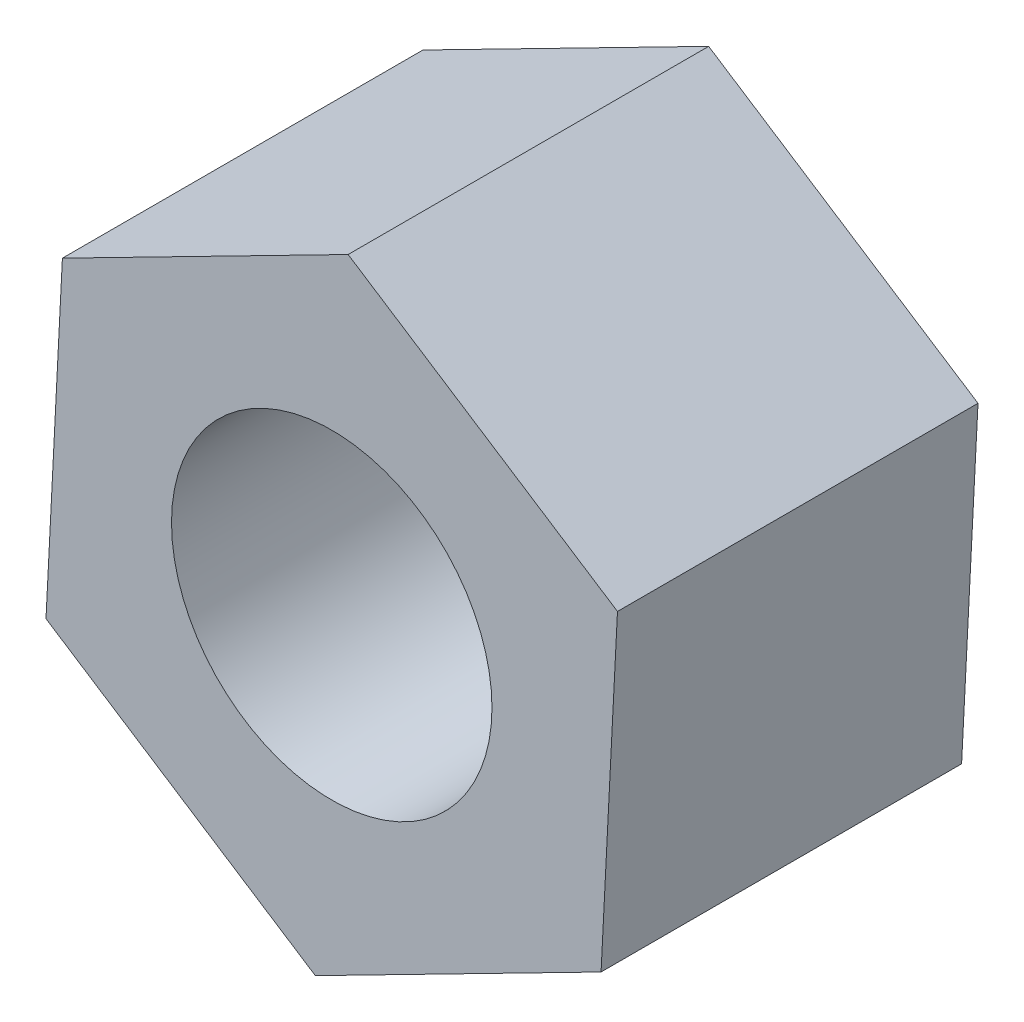
ISO-10303-21;
HEADER;
FILE_DESCRIPTION(('STEP AP214'),'2;1');
FILE_NAME('part.step','',(''),(''),'','','');
FILE_SCHEMA(('AUTOMOTIVE_DESIGN { 1 0 10303 214 1 1 1 1 }'));
ENDSEC;
DATA;
#1=APPLICATION_CONTEXT('core data for automotive mechanical design processes');
#2=APPLICATION_PROTOCOL_DEFINITION('international standard','automotive_design',2000,#1);
#3=PRODUCT_CONTEXT('',#1,'mechanical');
#4=PRODUCT('Part','Part','',(#3));
#5=PRODUCT_RELATED_PRODUCT_CATEGORY('part','',(#4));
#6=PRODUCT_DEFINITION_FORMATION('','',#4);
#7=PRODUCT_DEFINITION_CONTEXT('part definition',#1,'design');
#8=PRODUCT_DEFINITION('design','',#6,#7);
#9=PRODUCT_DEFINITION_SHAPE('','',#8);
#10=(LENGTH_UNIT() NAMED_UNIT(*) SI_UNIT(.MILLI.,.METRE.));
#11=(NAMED_UNIT(*) PLANE_ANGLE_UNIT() SI_UNIT($,.RADIAN.));
#12=(NAMED_UNIT(*) SI_UNIT($,.STERADIAN.) SOLID_ANGLE_UNIT());
#13=UNCERTAINTY_MEASURE_WITH_UNIT(LENGTH_MEASURE(1.E-05),#10,'distance_accuracy_value','');
#14=(GEOMETRIC_REPRESENTATION_CONTEXT(3) GLOBAL_UNCERTAINTY_ASSIGNED_CONTEXT((#13)) GLOBAL_UNIT_ASSIGNED_CONTEXT((#10,
#11,#12)) REPRESENTATION_CONTEXT('',''));
#15=CARTESIAN_POINT('',(0.,0.,0.));
#16=DIRECTION('',(0.,0.,1.));
#17=DIRECTION('',(1.,0.,0.));
#18=AXIS2_PLACEMENT_3D('',#15,#16,#17);
#19=CARTESIAN_POINT('',(-0.409591376524883,-8.,4.5));
#20=DIRECTION('',(-0.455064386320172,0.890458535981909,0.));
#21=DIRECTION('',(-0.890458535981909,-0.455064386320172,0.));
#22=AXIS2_PLACEMENT_3D('',#19,#20,#21);
#23=PLANE('',#22);
#24=DIRECTION('',(0.890458535981909,0.455064386320172,0.));
#25=VECTOR('',#24,1.);
#26=CARTESIAN_POINT('',(-0.409591376524883,-8.,-4.5));
#27=LINE('',#26,#25);
#28=CARTESIAN_POINT('',(-0.409591376524883,-8.,-4.5));
#29=VERTEX_POINT('',#28);
#30=CARTESIAN_POINT('',(6.72340754201307,-4.35471653724159,-4.5));
#31=VERTEX_POINT('',#30);
#32=EDGE_CURVE('E116',#29,#31,#27,.T.);
#33=ORIENTED_EDGE('',*,*,#32,.T.);
#34=DIRECTION('',(0.,0.,-1.));
#35=VECTOR('',#34,1.);
#36=CARTESIAN_POINT('',(6.72340754201307,-4.35471653724159,4.5));
#37=LINE('',#36,#35);
#38=CARTESIAN_POINT('',(6.72340754201307,-4.35471653724159,4.5));
#39=VERTEX_POINT('',#38);
#40=EDGE_CURVE('E11',#39,#31,#37,.T.);
#41=ORIENTED_EDGE('',*,*,#40,.F.);
#42=DIRECTION('',(0.890458535981909,0.455064386320172,0.));
#43=VECTOR('',#42,1.);
#44=CARTESIAN_POINT('',(-0.409591376524883,-8.,4.5));
#45=LINE('',#44,#43);
#46=CARTESIAN_POINT('',(-0.409591376524883,-8.,4.5));
#47=VERTEX_POINT('',#46);
#48=EDGE_CURVE('E127',#47,#39,#45,.T.);
#49=ORIENTED_EDGE('',*,*,#48,.F.);
#50=DIRECTION('',(0.,0.,-1.));
#51=VECTOR('',#50,1.);
#52=CARTESIAN_POINT('',(-0.409591376524883,-8.,4.5));
#53=LINE('',#52,#51);
#54=EDGE_CURVE('E112',#47,#29,#53,.T.);
#55=ORIENTED_EDGE('',*,*,#54,.T.);
#56=EDGE_LOOP('',(#33,#41,#49,#55));
#57=FACE_BOUND('',#56,.T.);
#58=ADVANCED_FACE('F32',(#57),#23,.F.);
#59=CARTESIAN_POINT('',(6.72340754201307,-4.35471653724159,4.5));
#60=DIRECTION('',(-0.998691906337119,0.0511319490801099,0.));
#61=DIRECTION('',(-0.05113194908011,-0.998691906337119,0.));
#62=AXIS2_PLACEMENT_3D('',#59,#60,#61);
#63=PLANE('',#62);
#64=DIRECTION('',(0.0511319490801099,0.998691906337119,0.));
#65=VECTOR('',#64,1.);
#66=CARTESIAN_POINT('',(6.72340754201307,-4.35471653724159,-4.5));
#67=LINE('',#66,#65);
#68=CARTESIAN_POINT('',(7.13299891853795,3.64528346275841,-4.5));
#69=VERTEX_POINT('',#68);
#70=EDGE_CURVE('E119',#31,#69,#67,.T.);
#71=ORIENTED_EDGE('',*,*,#70,.T.);
#72=DIRECTION('',(0.,0.,-1.));
#73=VECTOR('',#72,1.);
#74=CARTESIAN_POINT('',(7.13299891853795,3.64528346275841,4.5));
#75=LINE('',#74,#73);
#76=CARTESIAN_POINT('',(7.13299891853795,3.64528346275841,4.5));
#77=VERTEX_POINT('',#76);
#78=EDGE_CURVE('E40',#77,#69,#75,.T.);
#79=ORIENTED_EDGE('',*,*,#78,.F.);
#80=DIRECTION('',(0.0511319490801099,0.998691906337119,0.));
#81=VECTOR('',#80,1.);
#82=CARTESIAN_POINT('',(6.72340754201307,-4.35471653724159,4.5));
#83=LINE('',#82,#81);
#84=EDGE_CURVE('E85',#39,#77,#83,.T.);
#85=ORIENTED_EDGE('',*,*,#84,.F.);
#86=ORIENTED_EDGE('',*,*,#40,.T.);
#87=EDGE_LOOP('',(#71,#79,#85,#86));
#88=FACE_BOUND('',#87,.T.);
#89=ADVANCED_FACE('F152',(#88),#63,.F.);
#90=CARTESIAN_POINT('',(7.13299891853795,3.64528346275841,4.5));
#91=DIRECTION('',(-0.543627520016947,-0.839326586901799,0.));
#92=DIRECTION('',(0.839326586901799,-0.543627520016947,0.));
#93=AXIS2_PLACEMENT_3D('',#90,#91,#92);
#94=PLANE('',#93);
#95=DIRECTION('',(-0.839326586901799,0.543627520016947,0.));
#96=VECTOR('',#95,1.);
#97=CARTESIAN_POINT('',(7.13299891853795,3.64528346275841,-4.5));
#98=LINE('',#97,#96);
#99=CARTESIAN_POINT('',(0.409591376524884,8.,-4.5));
#100=VERTEX_POINT('',#99);
#101=EDGE_CURVE('E122',#69,#100,#98,.T.);
#102=ORIENTED_EDGE('',*,*,#101,.T.);
#103=DIRECTION('',(0.,0.,-1.));
#104=VECTOR('',#103,1.);
#105=CARTESIAN_POINT('',(0.409591376524884,8.,4.5));
#106=LINE('',#105,#104);
#107=CARTESIAN_POINT('',(0.409591376524884,8.,4.5));
#108=VERTEX_POINT('',#107);
#109=EDGE_CURVE('E107',#108,#100,#106,.T.);
#110=ORIENTED_EDGE('',*,*,#109,.F.);
#111=DIRECTION('',(-0.839326586901799,0.543627520016947,0.));
#112=VECTOR('',#111,1.);
#113=CARTESIAN_POINT('',(7.13299891853795,3.64528346275841,4.5));
#114=LINE('',#113,#112);
#115=EDGE_CURVE('E98',#77,#108,#114,.T.);
#116=ORIENTED_EDGE('',*,*,#115,.F.);
#117=ORIENTED_EDGE('',*,*,#78,.T.);
#118=EDGE_LOOP('',(#102,#110,#116,#117));
#119=FACE_BOUND('',#118,.T.);
#120=ADVANCED_FACE('F133',(#119),#94,.F.);
#121=CARTESIAN_POINT('',(0.409591376524884,8.,4.5));
#122=DIRECTION('',(0.455064386320172,-0.890458535981909,0.));
#123=DIRECTION('',(0.89045853598191,0.455064386320172,0.));
#124=AXIS2_PLACEMENT_3D('',#121,#122,#123);
#125=PLANE('',#124);
#126=DIRECTION('',(-0.890458535981909,-0.455064386320172,0.));
#127=VECTOR('',#126,1.);
#128=CARTESIAN_POINT('',(0.409591376524884,8.,-4.5));
#129=LINE('',#128,#127);
#130=CARTESIAN_POINT('',(-6.72340754201307,4.35471653724159,-4.5));
#131=VERTEX_POINT('',#130);
#132=EDGE_CURVE('E106',#100,#131,#129,.T.);
#133=ORIENTED_EDGE('',*,*,#132,.T.);
#134=DIRECTION('',(0.,0.,-1.));
#135=VECTOR('',#134,1.);
#136=CARTESIAN_POINT('',(-6.72340754201307,4.35471653724159,4.5));
#137=LINE('',#136,#135);
#138=CARTESIAN_POINT('',(-6.72340754201307,4.35471653724159,4.5));
#139=VERTEX_POINT('',#138);
#140=EDGE_CURVE('E103',#139,#131,#137,.T.);
#141=ORIENTED_EDGE('',*,*,#140,.F.);
#142=DIRECTION('',(-0.890458535981909,-0.455064386320172,0.));
#143=VECTOR('',#142,1.);
#144=CARTESIAN_POINT('',(0.409591376524884,8.,4.5));
#145=LINE('',#144,#143);
#146=EDGE_CURVE('E92',#108,#139,#145,.T.);
#147=ORIENTED_EDGE('',*,*,#146,.F.);
#148=ORIENTED_EDGE('',*,*,#109,.T.);
#149=EDGE_LOOP('',(#133,#141,#147,#148));
#150=FACE_BOUND('',#149,.T.);
#151=ADVANCED_FACE('F104',(#150),#125,.F.);
#152=CARTESIAN_POINT('',(-6.72340754201307,4.35471653724159,4.5));
#153=DIRECTION('',(0.998691906337119,-0.0511319490801098,0.));
#154=DIRECTION('',(0.0511319490801099,0.998691906337119,0.));
#155=AXIS2_PLACEMENT_3D('',#152,#153,#154);
#156=PLANE('',#155);
#157=DIRECTION('',(-0.0511319490801098,-0.998691906337119,0.));
#158=VECTOR('',#157,1.);
#159=CARTESIAN_POINT('',(-6.72340754201307,4.35471653724159,-4.5));
#160=LINE('',#159,#158);
#161=CARTESIAN_POINT('',(-7.13299891853795,-3.64528346275841,-4.5));
#162=VERTEX_POINT('',#161);
#163=EDGE_CURVE('E71',#131,#162,#160,.T.);
#164=ORIENTED_EDGE('',*,*,#163,.T.);
#165=DIRECTION('',(0.,0.,-1.));
#166=VECTOR('',#165,1.);
#167=CARTESIAN_POINT('',(-7.13299891853795,-3.64528346275841,4.5));
#168=LINE('',#167,#166);
#169=CARTESIAN_POINT('',(-7.13299891853795,-3.64528346275841,4.5));
#170=VERTEX_POINT('',#169);
#171=EDGE_CURVE('E108',#170,#162,#168,.T.);
#172=ORIENTED_EDGE('',*,*,#171,.F.);
#173=DIRECTION('',(-0.0511319490801098,-0.998691906337119,0.));
#174=VECTOR('',#173,1.);
#175=CARTESIAN_POINT('',(-6.72340754201307,4.35471653724159,4.5));
#176=LINE('',#175,#174);
#177=EDGE_CURVE('E96',#139,#170,#176,.T.);
#178=ORIENTED_EDGE('',*,*,#177,.F.);
#179=ORIENTED_EDGE('',*,*,#140,.T.);
#180=EDGE_LOOP('',(#164,#172,#178,#179));
#181=FACE_BOUND('',#180,.T.);
#182=ADVANCED_FACE('F110',(#181),#156,.F.);
#183=CARTESIAN_POINT('',(-7.13299891853795,-3.64528346275841,4.5));
#184=DIRECTION('',(0.543627520016947,0.839326586901799,0.));
#185=DIRECTION('',(-0.8393265869018,0.543627520016947,0.));
#186=AXIS2_PLACEMENT_3D('',#183,#184,#185);
#187=PLANE('',#186);
#188=DIRECTION('',(0.839326586901799,-0.543627520016947,0.));
#189=VECTOR('',#188,1.);
#190=CARTESIAN_POINT('',(-7.13299891853795,-3.64528346275841,-4.5));
#191=LINE('',#190,#189);
#192=EDGE_CURVE('E77',#162,#29,#191,.T.);
#193=ORIENTED_EDGE('',*,*,#192,.T.);
#194=ORIENTED_EDGE('',*,*,#54,.F.);
#195=DIRECTION('',(0.839326586901799,-0.543627520016947,0.));
#196=VECTOR('',#195,1.);
#197=CARTESIAN_POINT('',(-7.13299891853795,-3.64528346275841,4.5));
#198=LINE('',#197,#196);
#199=EDGE_CURVE('E48',#170,#47,#198,.T.);
#200=ORIENTED_EDGE('',*,*,#199,.F.);
#201=ORIENTED_EDGE('',*,*,#171,.T.);
#202=EDGE_LOOP('',(#193,#194,#200,#201));
#203=FACE_BOUND('',#202,.T.);
#204=ADVANCED_FACE('F140',(#203),#187,.F.);
#205=CARTESIAN_POINT('',(0.,0.,4.5));
#206=DIRECTION('',(0.,0.,1.));
#207=DIRECTION('',(1.,0.,0.));
#208=AXIS2_PLACEMENT_3D('',#205,#206,#207);
#209=PLANE('',#208);
#210=CARTESIAN_POINT('',(0.,0.,4.5));
#211=DIRECTION('',(0.,0.,-1.));
#212=DIRECTION('',(-1.,0.,0.));
#213=AXIS2_PLACEMENT_3D('',#210,#211,#212);
#214=CIRCLE('',#213,4.);
#215=CARTESIAN_POINT('',(-4.,0.,4.5));
#216=VERTEX_POINT('',#215);
#217=EDGE_CURVE('E120',#216,#216,#214,.T.);
#218=ORIENTED_EDGE('',*,*,#217,.T.);
#219=EDGE_LOOP('',(#218));
#220=FACE_BOUND('',#219,.T.);
#221=ORIENTED_EDGE('',*,*,#48,.T.);
#222=ORIENTED_EDGE('',*,*,#84,.T.);
#223=ORIENTED_EDGE('',*,*,#115,.T.);
#224=ORIENTED_EDGE('',*,*,#146,.T.);
#225=ORIENTED_EDGE('',*,*,#177,.T.);
#226=ORIENTED_EDGE('',*,*,#199,.T.);
#227=EDGE_LOOP('',(#221,#222,#223,#224,#225,#226));
#228=FACE_BOUND('',#227,.T.);
#229=ADVANCED_FACE('F94',(#220,#228),#209,.T.);
#230=CARTESIAN_POINT('',(0.,0.,-4.5));
#231=DIRECTION('',(0.,0.,1.));
#232=DIRECTION('',(1.,0.,0.));
#233=AXIS2_PLACEMENT_3D('',#230,#231,#232);
#234=PLANE('',#233);
#235=CARTESIAN_POINT('',(0.,0.,-4.5));
#236=DIRECTION('',(0.,0.,-1.));
#237=DIRECTION('',(-1.,0.,0.));
#238=AXIS2_PLACEMENT_3D('',#235,#236,#237);
#239=CIRCLE('',#238,4.);
#240=CARTESIAN_POINT('',(-4.,0.,-4.5));
#241=VERTEX_POINT('',#240);
#242=EDGE_CURVE('E207',#241,#241,#239,.T.);
#243=ORIENTED_EDGE('',*,*,#242,.F.);
#244=EDGE_LOOP('',(#243));
#245=FACE_BOUND('',#244,.T.);
#246=ORIENTED_EDGE('',*,*,#32,.F.);
#247=ORIENTED_EDGE('',*,*,#192,.F.);
#248=ORIENTED_EDGE('',*,*,#163,.F.);
#249=ORIENTED_EDGE('',*,*,#132,.F.);
#250=ORIENTED_EDGE('',*,*,#101,.F.);
#251=ORIENTED_EDGE('',*,*,#70,.F.);
#252=EDGE_LOOP('',(#246,#247,#248,#249,#250,#251));
#253=FACE_BOUND('',#252,.T.);
#254=ADVANCED_FACE('F136',(#245,#253),#234,.F.);
#255=CARTESIAN_POINT('',(0.,0.,4.5));
#256=DIRECTION('',(0.,0.,-1.));
#257=DIRECTION('',(-1.,0.,0.));
#258=AXIS2_PLACEMENT_3D('',#255,#256,#257);
#259=CYLINDRICAL_SURFACE('',#258,4.);
#260=ORIENTED_EDGE('',*,*,#217,.F.);
#261=EDGE_LOOP('',(#260));
#262=FACE_BOUND('',#261,.T.);
#263=ORIENTED_EDGE('',*,*,#242,.T.);
#264=EDGE_LOOP('',(#263));
#265=FACE_BOUND('',#264,.T.);
#266=ADVANCED_FACE('F189',(#262,#265),#259,.F.);
#267=CLOSED_SHELL('',(#58,#89,#120,#151,#182,#204,#229,#254,#266));
#268=MANIFOLD_SOLID_BREP('B2',#267);
#269=ADVANCED_BREP_SHAPE_REPRESENTATION('',(#18,#268),#14);
#270=SHAPE_DEFINITION_REPRESENTATION(#9,#269);
ENDSEC;
END-ISO-10303-21;
